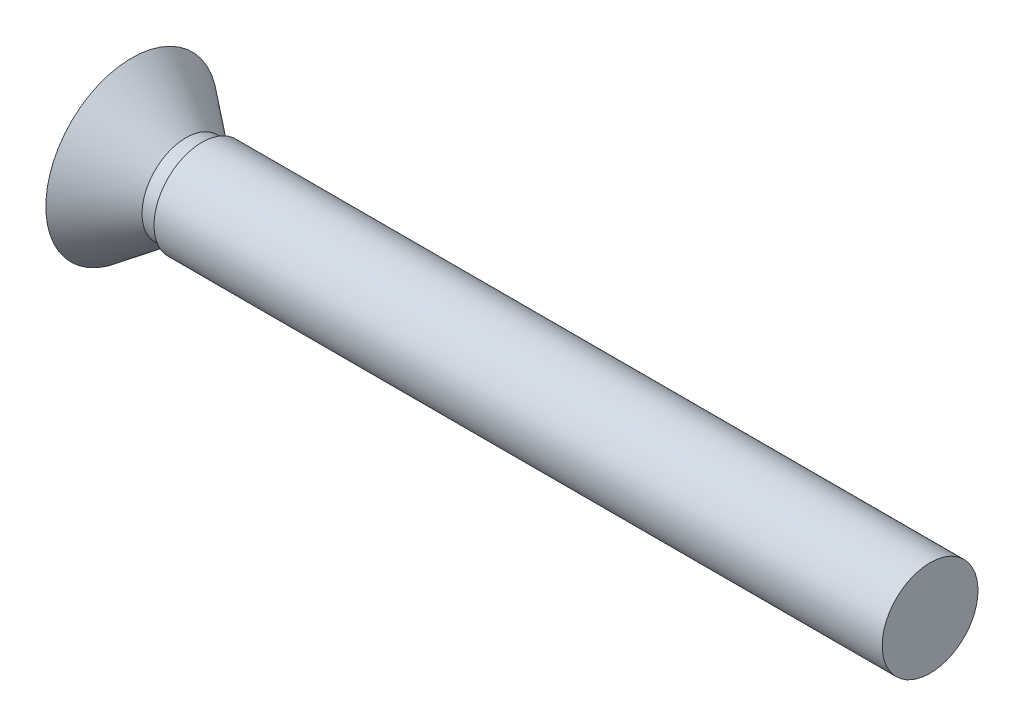
ISO-10303-21;
HEADER;
FILE_DESCRIPTION(('STEP AP214'),'2;1');
FILE_NAME('part.step','',(''),(''),'','','');
FILE_SCHEMA(('AUTOMOTIVE_DESIGN { 1 0 10303 214 1 1 1 1 }'));
ENDSEC;
DATA;
#1=APPLICATION_CONTEXT('core data for automotive mechanical design processes');
#2=APPLICATION_PROTOCOL_DEFINITION('international standard','automotive_design',2000,#1);
#3=PRODUCT_CONTEXT('',#1,'mechanical');
#4=PRODUCT('Part','Part','',(#3));
#5=PRODUCT_RELATED_PRODUCT_CATEGORY('part','',(#4));
#6=PRODUCT_DEFINITION_FORMATION('','',#4);
#7=PRODUCT_DEFINITION_CONTEXT('part definition',#1,'design');
#8=PRODUCT_DEFINITION('design','',#6,#7);
#9=PRODUCT_DEFINITION_SHAPE('','',#8);
#10=(LENGTH_UNIT() NAMED_UNIT(*) SI_UNIT(.MILLI.,.METRE.));
#11=(NAMED_UNIT(*) PLANE_ANGLE_UNIT() SI_UNIT($,.RADIAN.));
#12=(NAMED_UNIT(*) SI_UNIT($,.STERADIAN.) SOLID_ANGLE_UNIT());
#13=UNCERTAINTY_MEASURE_WITH_UNIT(LENGTH_MEASURE(1.E-05),#10,'distance_accuracy_value','');
#14=(GEOMETRIC_REPRESENTATION_CONTEXT(3) GLOBAL_UNCERTAINTY_ASSIGNED_CONTEXT((#13)) GLOBAL_UNIT_ASSIGNED_CONTEXT((#10,
#11,#12)) REPRESENTATION_CONTEXT('',''));
#15=CARTESIAN_POINT('',(0.,0.,0.));
#16=DIRECTION('',(0.,0.,1.));
#17=DIRECTION('',(1.,0.,0.));
#18=AXIS2_PLACEMENT_3D('',#15,#16,#17);
#19=CARTESIAN_POINT('',(0.,0.,0.));
#20=DIRECTION('',(1.,0.,0.));
#21=DIRECTION('',(0.,0.,-1.));
#22=AXIS2_PLACEMENT_3D('',#19,#20,#21);
#23=PLANE('',#22);
#24=CARTESIAN_POINT('',(0.,0.,0.));
#25=DIRECTION('',(1.,0.,0.));
#26=DIRECTION('',(0.,0.,-1.));
#27=AXIS2_PLACEMENT_3D('',#24,#25,#26);
#28=CIRCLE('',#27,3.);
#29=CARTESIAN_POINT('',(0.,0.,-3.));
#30=VERTEX_POINT('',#29);
#31=EDGE_CURVE('E10',#30,#30,#28,.T.);
#32=ORIENTED_EDGE('',*,*,#31,.T.);
#33=EDGE_LOOP('',(#32));
#34=FACE_BOUND('',#33,.T.);
#35=ADVANCED_FACE('F32',(#34),#23,.T.);
#36=CARTESIAN_POINT('',(0.,0.,0.));
#37=DIRECTION('',(1.,0.,0.));
#38=DIRECTION('',(0.,0.,-1.));
#39=AXIS2_PLACEMENT_3D('',#36,#37,#38);
#40=CYLINDRICAL_SURFACE('',#39,3.);
#41=CARTESIAN_POINT('',(-45.6,0.,0.));
#42=DIRECTION('',(1.,0.,0.));
#43=DIRECTION('',(0.,0.,-1.));
#44=AXIS2_PLACEMENT_3D('',#41,#42,#43);
#45=CIRCLE('',#44,3.);
#46=CARTESIAN_POINT('',(-45.6,0.,-2.99999999999999));
#47=VERTEX_POINT('',#46);
#48=EDGE_CURVE('E38',#47,#47,#45,.T.);
#49=ORIENTED_EDGE('',*,*,#48,.T.);
#50=EDGE_LOOP('',(#49));
#51=FACE_BOUND('',#50,.T.);
#52=ORIENTED_EDGE('',*,*,#31,.F.);
#53=EDGE_LOOP('',(#52));
#54=FACE_BOUND('',#53,.T.);
#55=ADVANCED_FACE('F67',(#51,#54),#40,.T.);
#56=CARTESIAN_POINT('',(-45.6,0.,-2.99999999999999));
#57=DIRECTION('',(-1.,0.,0.));
#58=DIRECTION('',(0.,0.,1.));
#59=AXIS2_PLACEMENT_3D('',#56,#57,#58);
#60=PLANE('',#59);
#61=CARTESIAN_POINT('',(-45.6,0.,0.));
#62=DIRECTION('',(1.,0.,0.));
#63=DIRECTION('',(0.,0.,-1.));
#64=AXIS2_PLACEMENT_3D('',#61,#62,#63);
#65=CIRCLE('',#64,2.75);
#66=CARTESIAN_POINT('',(-45.6,0.,-2.74999999999999));
#67=VERTEX_POINT('',#66);
#68=EDGE_CURVE('E42',#67,#67,#65,.T.);
#69=ORIENTED_EDGE('',*,*,#68,.T.);
#70=EDGE_LOOP('',(#69));
#71=FACE_BOUND('',#70,.T.);
#72=ORIENTED_EDGE('',*,*,#48,.F.);
#73=EDGE_LOOP('',(#72));
#74=FACE_BOUND('',#73,.T.);
#75=ADVANCED_FACE('F71',(#71,#74),#60,.T.);
#76=CARTESIAN_POINT('',(0.,0.,0.));
#77=DIRECTION('',(1.,0.,0.));
#78=DIRECTION('',(0.,0.,-1.));
#79=AXIS2_PLACEMENT_3D('',#76,#77,#78);
#80=CYLINDRICAL_SURFACE('',#79,2.75);
#81=CARTESIAN_POINT('',(-46.6,0.,0.));
#82=DIRECTION('',(1.,0.,0.));
#83=DIRECTION('',(0.,0.,-1.));
#84=AXIS2_PLACEMENT_3D('',#81,#82,#83);
#85=CIRCLE('',#84,2.75);
#86=CARTESIAN_POINT('',(-46.6,0.,-2.74999999999999));
#87=VERTEX_POINT('',#86);
#88=EDGE_CURVE('E46',#87,#87,#85,.T.);
#89=ORIENTED_EDGE('',*,*,#88,.T.);
#90=EDGE_LOOP('',(#89));
#91=FACE_BOUND('',#90,.T.);
#92=ORIENTED_EDGE('',*,*,#68,.F.);
#93=EDGE_LOOP('',(#92));
#94=FACE_BOUND('',#93,.T.);
#95=ADVANCED_FACE('F64',(#91,#94),#80,.T.);
#96=CARTESIAN_POINT('',(-46.6,0.,0.));
#97=DIRECTION('',(-1.,0.,0.));
#98=DIRECTION('',(0.,0.,1.));
#99=AXIS2_PLACEMENT_3D('',#96,#97,#98);
#100=CONICAL_SURFACE('',#99,2.75,0.657469932399471);
#101=CARTESIAN_POINT('',(-50.,0.,0.));
#102=DIRECTION('',(1.,0.,0.));
#103=DIRECTION('',(0.,0.,-1.));
#104=AXIS2_PLACEMENT_3D('',#101,#102,#103);
#105=CIRCLE('',#104,5.375);
#106=CARTESIAN_POINT('',(-50.,0.,-5.37499999999999));
#107=VERTEX_POINT('',#106);
#108=EDGE_CURVE('E51',#107,#107,#105,.T.);
#109=ORIENTED_EDGE('',*,*,#108,.T.);
#110=EDGE_LOOP('',(#109));
#111=FACE_BOUND('',#110,.T.);
#112=ORIENTED_EDGE('',*,*,#88,.F.);
#113=EDGE_LOOP('',(#112));
#114=FACE_BOUND('',#113,.T.);
#115=ADVANCED_FACE('F55',(#111,#114),#100,.T.);
#116=CARTESIAN_POINT('',(-50.,0.,-5.37499999999999));
#117=DIRECTION('',(-1.,0.,0.));
#118=DIRECTION('',(0.,0.,1.));
#119=AXIS2_PLACEMENT_3D('',#116,#117,#118);
#120=PLANE('',#119);
#121=ORIENTED_EDGE('',*,*,#108,.F.);
#122=EDGE_LOOP('',(#121));
#123=FACE_BOUND('',#122,.T.);
#124=ADVANCED_FACE('F58',(#123),#120,.T.);
#125=CLOSED_SHELL('',(#35,#55,#75,#95,#115,#124));
#126=MANIFOLD_SOLID_BREP('B2',#125);
#127=ADVANCED_BREP_SHAPE_REPRESENTATION('',(#18,#126),#14);
#128=SHAPE_DEFINITION_REPRESENTATION(#9,#127);
ENDSEC;
END-ISO-10303-21;
